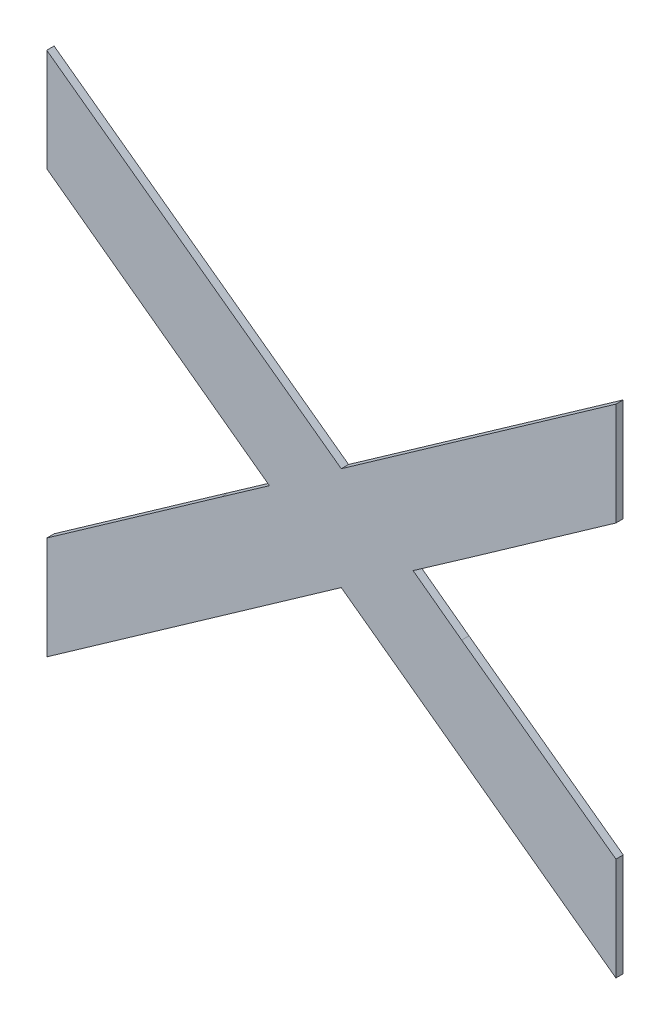
ISO-10303-21;
HEADER;
FILE_DESCRIPTION(('STEP AP214'),'2;1');
FILE_NAME('part.step','',(''),(''),'','','');
FILE_SCHEMA(('AUTOMOTIVE_DESIGN { 1 0 10303 214 1 1 1 1 }'));
ENDSEC;
DATA;
#1=APPLICATION_CONTEXT('core data for automotive mechanical design processes');
#2=APPLICATION_PROTOCOL_DEFINITION('international standard','automotive_design',2000,#1);
#3=PRODUCT_CONTEXT('',#1,'mechanical');
#4=PRODUCT('Part','Part','',(#3));
#5=PRODUCT_RELATED_PRODUCT_CATEGORY('part','',(#4));
#6=PRODUCT_DEFINITION_FORMATION('','',#4);
#7=PRODUCT_DEFINITION_CONTEXT('part definition',#1,'design');
#8=PRODUCT_DEFINITION('design','',#6,#7);
#9=PRODUCT_DEFINITION_SHAPE('','',#8);
#10=(LENGTH_UNIT() NAMED_UNIT(*) SI_UNIT(.MILLI.,.METRE.));
#11=(NAMED_UNIT(*) PLANE_ANGLE_UNIT() SI_UNIT($,.RADIAN.));
#12=(NAMED_UNIT(*) SI_UNIT($,.STERADIAN.) SOLID_ANGLE_UNIT());
#13=UNCERTAINTY_MEASURE_WITH_UNIT(LENGTH_MEASURE(1.E-05),#10,'distance_accuracy_value','');
#14=(GEOMETRIC_REPRESENTATION_CONTEXT(3) GLOBAL_UNCERTAINTY_ASSIGNED_CONTEXT((#13)) GLOBAL_UNIT_ASSIGNED_CONTEXT((#10,
#11,#12)) REPRESENTATION_CONTEXT('',''));
#15=CARTESIAN_POINT('',(0.,0.,0.));
#16=DIRECTION('',(0.,0.,1.));
#17=DIRECTION('',(1.,0.,0.));
#18=AXIS2_PLACEMENT_3D('',#15,#16,#17);
#19=CARTESIAN_POINT('',(1.151957455164,1.4491077046924,1.7496000059366));
#20=DIRECTION('',(0.589899014408719,0.807477029270568,0.));
#21=DIRECTION('',(0.,0.,-1.));
#22=AXIS2_PLACEMENT_3D('',#19,#20,#21);
#23=PLANE('',#22);
#24=DIRECTION('',(0.,0.,1.));
#25=VECTOR('',#24,1.);
#26=CARTESIAN_POINT('',(1.1439141430621,1.4549837131849,1.7492000059366));
#27=LINE('',#26,#25);
#28=CARTESIAN_POINT('',(1.1439141430621,1.4549837131849,1.7492000059366));
#29=VERTEX_POINT('',#28);
#30=CARTESIAN_POINT('',(1.1439141430621,1.4549837131849,1.7496000059366));
#31=VERTEX_POINT('',#30);
#32=EDGE_CURVE('E11',#29,#31,#27,.T.);
#33=ORIENTED_EDGE('',*,*,#32,.T.);
#34=DIRECTION('',(0.807477029270569,-0.589899014408719,0.));
#35=VECTOR('',#34,1.);
#36=CARTESIAN_POINT('',(1.1439141430621,1.4549837131849,1.7496000059366));
#37=LINE('',#36,#35);
#38=CARTESIAN_POINT('',(1.1600007672659,1.4432316961999,1.7496000059366));
#39=VERTEX_POINT('',#38);
#40=EDGE_CURVE('E24',#31,#39,#37,.T.);
#41=ORIENTED_EDGE('',*,*,#40,.T.);
#42=DIRECTION('',(0.,0.,1.));
#43=VECTOR('',#42,1.);
#44=CARTESIAN_POINT('',(1.1600007672659,1.4432316961999,1.7492000059366));
#45=LINE('',#44,#43);
#46=CARTESIAN_POINT('',(1.1600007672659,1.4432316961999,1.7492000059366));
#47=VERTEX_POINT('',#46);
#48=EDGE_CURVE('E249',#47,#39,#45,.T.);
#49=ORIENTED_EDGE('',*,*,#48,.F.);
#50=DIRECTION('',(0.807477029270569,-0.589899014408719,0.));
#51=VECTOR('',#50,1.);
#52=CARTESIAN_POINT('',(1.1439141430621,1.4549837131849,1.7492000059366));
#53=LINE('',#52,#51);
#54=EDGE_CURVE('E247',#29,#47,#53,.T.);
#55=ORIENTED_EDGE('',*,*,#54,.F.);
#56=EDGE_LOOP('',(#33,#41,#49,#55));
#57=FACE_BOUND('',#56,.T.);
#58=ADVANCED_FACE('F17',(#57),#23,.T.);
#59=CARTESIAN_POINT('',(1.1675022534654,1.4485098278347,1.7496000059366));
#60=DIRECTION('',(-0.575442948121089,0.81784192449257,0.));
#61=DIRECTION('',(0.,0.,1.));
#62=AXIS2_PLACEMENT_3D('',#59,#60,#61);
#63=PLANE('',#62);
#64=ORIENTED_EDGE('',*,*,#48,.T.);
#65=DIRECTION('',(0.81784192449257,0.575442948121089,0.));
#66=VECTOR('',#65,1.);
#67=CARTESIAN_POINT('',(1.1600007672659,1.4432316961999,1.7496000059366));
#68=LINE('',#67,#66);
#69=CARTESIAN_POINT('',(1.1750037396649,1.4537879594695,1.7496000059366));
#70=VERTEX_POINT('',#69);
#71=EDGE_CURVE('E245',#39,#70,#68,.T.);
#72=ORIENTED_EDGE('',*,*,#71,.T.);
#73=DIRECTION('',(0.,0.,1.));
#74=VECTOR('',#73,1.);
#75=CARTESIAN_POINT('',(1.1750037396649,1.4537879594695,1.7492000059366));
#76=LINE('',#75,#74);
#77=CARTESIAN_POINT('',(1.1750037396649,1.4537879594695,1.7492000059366));
#78=VERTEX_POINT('',#77);
#79=EDGE_CURVE('E242',#78,#70,#76,.T.);
#80=ORIENTED_EDGE('',*,*,#79,.F.);
#81=DIRECTION('',(0.81784192449257,0.575442948121089,0.));
#82=VECTOR('',#81,1.);
#83=CARTESIAN_POINT('',(1.1600007672659,1.4432316961999,1.7492000059366));
#84=LINE('',#83,#82);
#85=EDGE_CURVE('E239',#47,#78,#84,.T.);
#86=ORIENTED_EDGE('',*,*,#85,.F.);
#87=EDGE_LOOP('',(#64,#72,#80,#86));
#88=FACE_BOUND('',#87,.T.);
#89=ADVANCED_FACE('F255',(#88),#63,.T.);
#90=CARTESIAN_POINT('',(1.1750037396649,1.4509760698729,1.7496000059366));
#91=DIRECTION('',(1.,0.,0.));
#92=DIRECTION('',(0.,0.,-1.));
#93=AXIS2_PLACEMENT_3D('',#90,#91,#92);
#94=PLANE('',#93);
#95=ORIENTED_EDGE('',*,*,#79,.T.);
#96=DIRECTION('',(0.,-1.,0.));
#97=VECTOR('',#96,1.);
#98=CARTESIAN_POINT('',(1.1750037396649,1.4537879594695,1.7496000059366));
#99=LINE('',#98,#97);
#100=CARTESIAN_POINT('',(1.1750037396649,1.4481641802763,1.7496000059366));
#101=VERTEX_POINT('',#100);
#102=EDGE_CURVE('E237',#70,#101,#99,.T.);
#103=ORIENTED_EDGE('',*,*,#102,.T.);
#104=DIRECTION('',(0.,0.,1.));
#105=VECTOR('',#104,1.);
#106=CARTESIAN_POINT('',(1.1750037396649,1.4481641802763,1.7492000059366));
#107=LINE('',#106,#105);
#108=CARTESIAN_POINT('',(1.1750037396649,1.4481641802763,1.7492000059366));
#109=VERTEX_POINT('',#108);
#110=EDGE_CURVE('E234',#109,#101,#107,.T.);
#111=ORIENTED_EDGE('',*,*,#110,.F.);
#112=DIRECTION('',(0.,-1.,0.));
#113=VECTOR('',#112,1.);
#114=CARTESIAN_POINT('',(1.1750037396649,1.4537879594695,1.7492000059366));
#115=LINE('',#114,#113);
#116=EDGE_CURVE('E231',#78,#109,#115,.T.);
#117=ORIENTED_EDGE('',*,*,#116,.F.);
#118=EDGE_LOOP('',(#95,#103,#111,#117));
#119=FACE_BOUND('',#118,.T.);
#120=ADVANCED_FACE('F261',(#119),#94,.T.);
#121=CARTESIAN_POINT('',(1.1709867545269,1.4453336070279,1.7496000059366));
#122=DIRECTION('',(0.576011277079091,-0.817441746351209,0.));
#123=DIRECTION('',(0.,0.,-1.));
#124=AXIS2_PLACEMENT_3D('',#121,#122,#123);
#125=PLANE('',#124);
#126=ORIENTED_EDGE('',*,*,#110,.T.);
#127=DIRECTION('',(-0.817441746351209,-0.576011277079091,0.));
#128=VECTOR('',#127,1.);
#129=CARTESIAN_POINT('',(1.1750037396649,1.4481641802763,1.7496000059366));
#130=LINE('',#129,#128);
#131=CARTESIAN_POINT('',(1.1669697693889,1.4425030337795,1.7496000059366));
#132=VERTEX_POINT('',#131);
#133=EDGE_CURVE('E229',#101,#132,#130,.T.);
#134=ORIENTED_EDGE('',*,*,#133,.T.);
#135=DIRECTION('',(0.,0.,1.));
#136=VECTOR('',#135,1.);
#137=CARTESIAN_POINT('',(1.1669697693889,1.4425030337795,1.7492000059366));
#138=LINE('',#137,#136);
#139=CARTESIAN_POINT('',(1.1669697693889,1.4425030337795,1.7492000059366));
#140=VERTEX_POINT('',#139);
#141=EDGE_CURVE('E226',#140,#132,#138,.T.);
#142=ORIENTED_EDGE('',*,*,#141,.F.);
#143=DIRECTION('',(-0.817441746351209,-0.576011277079091,0.));
#144=VECTOR('',#143,1.);
#145=CARTESIAN_POINT('',(1.1750037396649,1.4481641802763,1.7492000059366));
#146=LINE('',#145,#144);
#147=EDGE_CURVE('E220',#109,#140,#146,.T.);
#148=ORIENTED_EDGE('',*,*,#147,.F.);
#149=EDGE_LOOP('',(#126,#134,#142,#148));
#150=FACE_BOUND('',#149,.T.);
#151=ADVANCED_FACE('F265',(#150),#125,.T.);
#152=CARTESIAN_POINT('',(1.1669697693889,1.4425030337795,1.7496000059366));
#153=CARTESIAN_POINT('',(1.1669697693889,1.4425030337795,1.7491200059366));
#154=CARTESIAN_POINT('',(1.1650266696013,1.4411391271977,1.7496000059366));
#155=CARTESIAN_POINT('',(1.1650266696013,1.4411391271977,1.7491200059366));
#156=CARTESIAN_POINT('',(1.1639243341449,1.4403730974737,1.7496000059366));
#157=CARTESIAN_POINT('',(1.1639243341449,1.4403730974737,1.7491200059366));
#158=B_SPLINE_SURFACE_WITH_KNOTS('',2,1,((#152,#153),(#154,#155),(#156,#157)),.UNSPECIFIED.,.F.,
.F.,.F.,(3,3),(2,2),(0.,1.),(0.,0.000239999999999974),.UNSPECIFIED.);
#159=CARTESIAN_POINT('',(1.1669697693889,1.4425030337795,1.7496000059366));
#160=CARTESIAN_POINT('',(1.1650266696013,1.4411391271977,1.7496000059366));
#161=CARTESIAN_POINT('',(1.1639243341449,1.4403730974737,1.7496000059366));
#162=B_SPLINE_CURVE_WITH_KNOTS('',2,(#159,#160,#161),.UNSPECIFIED.,.F.,.F.,(3,3),(0.,1.),.UNSPECIFIED.);
#163=CARTESIAN_POINT('',(1.1639243342389,1.4403730974042,1.7496000059366));
#164=VERTEX_POINT('',#163);
#165=EDGE_CURVE('E216',#132,#164,#162,.T.);
#166=DIRECTION('',(0.,0.,1.));
#167=VECTOR('',#166,1.);
#168=CARTESIAN_POINT('',(1.1639243341449,1.4403730974737,1.7492000059366));
#169=LINE('',#168,#167);
#170=CARTESIAN_POINT('',(1.1639243342389,1.4403730974042,1.7492000059366));
#171=VERTEX_POINT('',#170);
#172=EDGE_CURVE('E210',#171,#164,#169,.T.);
#173=CARTESIAN_POINT('',(1.1669697693889,1.4425030337795,1.7492000059366));
#174=CARTESIAN_POINT('',(1.1650266696013,1.4411391271977,1.7492000059366));
#175=CARTESIAN_POINT('',(1.1639243341449,1.4403730974737,1.7492000059366));
#176=B_SPLINE_CURVE_WITH_KNOTS('',2,(#173,#174,#175),.UNSPECIFIED.,.F.,.F.,(3,3),(0.,1.),.UNSPECIFIED.);
#177=EDGE_CURVE('E205',#140,#171,#176,.T.);
#178=ORIENTED_EDGE('',*,*,#141,.T.);
#179=ORIENTED_EDGE('',*,*,#165,.T.);
#180=ORIENTED_EDGE('',*,*,#172,.F.);
#181=ORIENTED_EDGE('',*,*,#177,.F.);
#182=EDGE_LOOP('',(#178,#179,#180,#181));
#183=FACE_BOUND('',#182,.T.);
#184=ADVANCED_FACE('F269',(#183),#158,.T.);
#185=CARTESIAN_POINT('',(1.1651948224676,1.4394342439705,1.7496000059366));
#186=DIRECTION('',(0.594550260696468,0.804058447816925,0.));
#187=DIRECTION('',(0.,0.,-1.));
#188=AXIS2_PLACEMENT_3D('',#185,#186,#187);
#189=PLANE('',#188);
#190=ORIENTED_EDGE('',*,*,#172,.T.);
#191=DIRECTION('',(0.804058447816925,-0.594550260696468,0.));
#192=VECTOR('',#191,1.);
#193=CARTESIAN_POINT('',(1.1639243341449,1.4403730974737,1.7496000059366));
#194=LINE('',#193,#192);
#195=CARTESIAN_POINT('',(1.1665774128468,1.438411313928,1.7496000059366));
#196=VERTEX_POINT('',#195);
#197=EDGE_CURVE('E203',#164,#196,#194,.T.);
#198=ORIENTED_EDGE('',*,*,#197,.T.);
#199=DIRECTION('',(0.,0.,1.));
#200=VECTOR('',#199,1.);
#201=CARTESIAN_POINT('',(1.1665774127011,1.4384113140343,1.7492000059366));
#202=LINE('',#201,#200);
#203=CARTESIAN_POINT('',(1.1665774128468,1.438411313928,1.7492000059366));
#204=VERTEX_POINT('',#203);
#205=EDGE_CURVE('E200',#204,#196,#202,.T.);
#206=ORIENTED_EDGE('',*,*,#205,.F.);
#207=DIRECTION('',(0.804058447816925,-0.594550260696468,0.));
#208=VECTOR('',#207,1.);
#209=CARTESIAN_POINT('',(1.1639243341449,1.4403730974737,1.7492000059366));
#210=LINE('',#209,#208);
#211=EDGE_CURVE('E197',#171,#204,#210,.T.);
#212=ORIENTED_EDGE('',*,*,#211,.F.);
#213=EDGE_LOOP('',(#190,#198,#206,#212));
#214=FACE_BOUND('',#213,.T.);
#215=ADVANCED_FACE('F272',(#214),#189,.T.);
#216=CARTESIAN_POINT('',(1.170790576183,1.4353378533124,1.7496000059366));
#217=DIRECTION('',(0.589342697437153,0.807883150571604,0.));
#218=DIRECTION('',(0.,0.,-1.));
#219=AXIS2_PLACEMENT_3D('',#216,#217,#218);
#220=PLANE('',#219);
#221=ORIENTED_EDGE('',*,*,#205,.T.);
#222=DIRECTION('',(0.807883150571604,-0.589342697437153,0.));
#223=VECTOR('',#222,1.);
#224=CARTESIAN_POINT('',(1.1665774127011,1.4384113140343,1.7496000059366));
#225=LINE('',#224,#223);
#226=CARTESIAN_POINT('',(1.1750037396649,1.4322643925905,1.7496000059366));
#227=VERTEX_POINT('',#226);
#228=EDGE_CURVE('E195',#196,#227,#225,.T.);
#229=ORIENTED_EDGE('',*,*,#228,.T.);
#230=DIRECTION('',(0.,0.,1.));
#231=VECTOR('',#230,1.);
#232=CARTESIAN_POINT('',(1.1750037396649,1.4322643925905,1.7492000059366));
#233=LINE('',#232,#231);
#234=CARTESIAN_POINT('',(1.1750037396649,1.4322643925905,1.7492000059366));
#235=VERTEX_POINT('',#234);
#236=EDGE_CURVE('E192',#235,#227,#233,.T.);
#237=ORIENTED_EDGE('',*,*,#236,.F.);
#238=DIRECTION('',(0.807883150571604,-0.589342697437153,0.));
#239=VECTOR('',#238,1.);
#240=CARTESIAN_POINT('',(1.1665774127011,1.4384113140343,1.7492000059366));
#241=LINE('',#240,#239);
#242=EDGE_CURVE('E189',#204,#235,#241,.T.);
#243=ORIENTED_EDGE('',*,*,#242,.F.);
#244=EDGE_LOOP('',(#221,#229,#237,#243));
#245=FACE_BOUND('',#244,.T.);
#246=ADVANCED_FACE('F277',(#245),#220,.T.);
#247=CARTESIAN_POINT('',(1.1750037396649,1.4294525029939,1.7496000059366));
#248=DIRECTION('',(1.,0.,0.));
#249=DIRECTION('',(0.,0.,-1.));
#250=AXIS2_PLACEMENT_3D('',#247,#248,#249);
#251=PLANE('',#250);
#252=ORIENTED_EDGE('',*,*,#236,.T.);
#253=DIRECTION('',(0.,-1.,0.));
#254=VECTOR('',#253,1.);
#255=CARTESIAN_POINT('',(1.1750037396649,1.4322643925905,1.7496000059366));
#256=LINE('',#255,#254);
#257=CARTESIAN_POINT('',(1.1750037396649,1.4266406133973,1.7496000059366));
#258=VERTEX_POINT('',#257);
#259=EDGE_CURVE('E187',#227,#258,#256,.T.);
#260=ORIENTED_EDGE('',*,*,#259,.T.);
#261=DIRECTION('',(0.,0.,1.));
#262=VECTOR('',#261,1.);
#263=CARTESIAN_POINT('',(1.1750037396649,1.4266406133973,1.7492000059366));
#264=LINE('',#263,#262);
#265=CARTESIAN_POINT('',(1.1750037396649,1.4266406133973,1.7492000059366));
#266=VERTEX_POINT('',#265);
#267=EDGE_CURVE('E184',#266,#258,#264,.T.);
#268=ORIENTED_EDGE('',*,*,#267,.F.);
#269=DIRECTION('',(0.,-1.,0.));
#270=VECTOR('',#269,1.);
#271=CARTESIAN_POINT('',(1.1750037396649,1.4322643925905,1.7492000059366));
#272=LINE('',#271,#270);
#273=EDGE_CURVE('E181',#235,#266,#272,.T.);
#274=ORIENTED_EDGE('',*,*,#273,.F.);
#275=EDGE_LOOP('',(#252,#260,#268,#274));
#276=FACE_BOUND('',#275,.T.);
#277=ADVANCED_FACE('F281',(#276),#251,.T.);
#278=CARTESIAN_POINT('',(1.1675022534654,1.432124265202,1.7496000059366));
#279=DIRECTION('',(-0.590142614926871,-0.807299011548556,0.));
#280=DIRECTION('',(0.,0.,1.));
#281=AXIS2_PLACEMENT_3D('',#278,#279,#280);
#282=PLANE('',#281);
#283=ORIENTED_EDGE('',*,*,#267,.T.);
#284=DIRECTION('',(-0.807299011548556,0.590142614926871,0.));
#285=VECTOR('',#284,1.);
#286=CARTESIAN_POINT('',(1.1750037396649,1.4266406133973,1.7496000059366));
#287=LINE('',#286,#285);
#288=CARTESIAN_POINT('',(1.1600007672659,1.4376079170067,1.7496000059366));
#289=VERTEX_POINT('',#288);
#290=EDGE_CURVE('E179',#258,#289,#287,.T.);
#291=ORIENTED_EDGE('',*,*,#290,.T.);
#292=DIRECTION('',(0.,0.,1.));
#293=VECTOR('',#292,1.);
#294=CARTESIAN_POINT('',(1.1600007672659,1.4376079170067,1.7492000059366));
#295=LINE('',#294,#293);
#296=CARTESIAN_POINT('',(1.1600007672659,1.4376079170067,1.7492000059366));
#297=VERTEX_POINT('',#296);
#298=EDGE_CURVE('E176',#297,#289,#295,.T.);
#299=ORIENTED_EDGE('',*,*,#298,.F.);
#300=DIRECTION('',(-0.807299011548556,0.590142614926871,0.));
#301=VECTOR('',#300,1.);
#302=CARTESIAN_POINT('',(1.1750037396649,1.4266406133973,1.7492000059366));
#303=LINE('',#302,#301);
#304=EDGE_CURVE('E173',#266,#297,#303,.T.);
#305=ORIENTED_EDGE('',*,*,#304,.F.);
#306=EDGE_LOOP('',(#283,#291,#299,#305));
#307=FACE_BOUND('',#306,.T.);
#308=ADVANCED_FACE('F285',(#307),#282,.T.);
#309=CARTESIAN_POINT('',(1.151957455164,1.4319467705098,1.7496000059366));
#310=DIRECTION('',(0.575563983688675,-0.817756749088886,0.));
#311=DIRECTION('',(0.,0.,-1.));
#312=AXIS2_PLACEMENT_3D('',#309,#310,#311);
#313=PLANE('',#312);
#314=ORIENTED_EDGE('',*,*,#298,.T.);
#315=DIRECTION('',(-0.817756749088886,-0.575563983688675,0.));
#316=VECTOR('',#315,1.);
#317=CARTESIAN_POINT('',(1.1600007672659,1.4376079170067,1.7496000059366));
#318=LINE('',#317,#316);
#319=CARTESIAN_POINT('',(1.1439141430621,1.4262856240129,1.7496000059366));
#320=VERTEX_POINT('',#319);
#321=EDGE_CURVE('E171',#289,#320,#318,.T.);
#322=ORIENTED_EDGE('',*,*,#321,.T.);
#323=DIRECTION('',(0.,0.,1.));
#324=VECTOR('',#323,1.);
#325=CARTESIAN_POINT('',(1.1439141430621,1.4262856240129,1.7492000059366));
#326=LINE('',#325,#324);
#327=CARTESIAN_POINT('',(1.1439141430621,1.4262856240129,1.7492000059366));
#328=VERTEX_POINT('',#327);
#329=EDGE_CURVE('E168',#328,#320,#326,.T.);
#330=ORIENTED_EDGE('',*,*,#329,.F.);
#331=DIRECTION('',(-0.817756749088886,-0.575563983688675,0.));
#332=VECTOR('',#331,1.);
#333=CARTESIAN_POINT('',(1.1600007672659,1.4376079170067,1.7492000059366));
#334=LINE('',#333,#332);
#335=EDGE_CURVE('E165',#297,#328,#334,.T.);
#336=ORIENTED_EDGE('',*,*,#335,.F.);
#337=EDGE_LOOP('',(#314,#322,#330,#336));
#338=FACE_BOUND('',#337,.T.);
#339=ADVANCED_FACE('F288',(#338),#313,.T.);
#340=CARTESIAN_POINT('',(1.1439141430621,1.4290975136096,1.7496000059366));
#341=DIRECTION('',(-1.,0.,0.));
#342=DIRECTION('',(0.,0.,1.));
#343=AXIS2_PLACEMENT_3D('',#340,#341,#342);
#344=PLANE('',#343);
#345=ORIENTED_EDGE('',*,*,#329,.T.);
#346=DIRECTION('',(0.,1.,0.));
#347=VECTOR('',#346,1.);
#348=CARTESIAN_POINT('',(1.1439141430621,1.4262856240129,1.7496000059366));
#349=LINE('',#348,#347);
#350=CARTESIAN_POINT('',(1.1439141430621,1.4319094032063,1.7496000059366));
#351=VERTEX_POINT('',#350);
#352=EDGE_CURVE('E163',#320,#351,#349,.T.);
#353=ORIENTED_EDGE('',*,*,#352,.T.);
#354=DIRECTION('',(0.,0.,1.));
#355=VECTOR('',#354,1.);
#356=CARTESIAN_POINT('',(1.1439141430621,1.4319094032063,1.7492000059366));
#357=LINE('',#356,#355);
#358=CARTESIAN_POINT('',(1.1439141430621,1.4319094032063,1.7492000059366));
#359=VERTEX_POINT('',#358);
#360=EDGE_CURVE('E160',#359,#351,#357,.T.);
#361=ORIENTED_EDGE('',*,*,#360,.F.);
#362=DIRECTION('',(0.,1.,0.));
#363=VECTOR('',#362,1.);
#364=CARTESIAN_POINT('',(1.1439141430621,1.4262856240129,1.7492000059366));
#365=LINE('',#364,#363);
#366=EDGE_CURVE('E157',#328,#359,#365,.T.);
#367=ORIENTED_EDGE('',*,*,#366,.F.);
#368=EDGE_LOOP('',(#345,#353,#361,#367));
#369=FACE_BOUND('',#368,.T.);
#370=ADVANCED_FACE('F293',(#369),#344,.T.);
#371=CARTESIAN_POINT('',(1.1486784742722,1.4352631187052,1.7496000059366));
#372=DIRECTION('',(-0.575612550146399,0.817722564268566,0.));
#373=DIRECTION('',(0.,0.,1.));
#374=AXIS2_PLACEMENT_3D('',#371,#372,#373);
#375=PLANE('',#374);
#376=ORIENTED_EDGE('',*,*,#360,.T.);
#377=DIRECTION('',(0.817722564268566,0.575612550146399,0.));
#378=VECTOR('',#377,1.);
#379=CARTESIAN_POINT('',(1.1439141430621,1.4319094032063,1.7496000059366));
#380=LINE('',#379,#378);
#381=CARTESIAN_POINT('',(1.1534428054823,1.4386168342041,1.7496000059366));
#382=VERTEX_POINT('',#381);
#383=EDGE_CURVE('E155',#351,#382,#380,.T.);
#384=ORIENTED_EDGE('',*,*,#383,.T.);
#385=DIRECTION('',(0.,0.,1.));
#386=VECTOR('',#385,1.);
#387=CARTESIAN_POINT('',(1.1534428054823,1.4386168342041,1.7492000059366));
#388=LINE('',#387,#386);
#389=CARTESIAN_POINT('',(1.1534428054823,1.4386168342041,1.7492000059366));
#390=VERTEX_POINT('',#389);
#391=EDGE_CURVE('E152',#390,#382,#388,.T.);
#392=ORIENTED_EDGE('',*,*,#391,.F.);
#393=DIRECTION('',(0.817722564268566,0.575612550146399,0.));
#394=VECTOR('',#393,1.);
#395=CARTESIAN_POINT('',(1.1439141430621,1.4319094032063,1.7492000059366));
#396=LINE('',#395,#394);
#397=EDGE_CURVE('E150',#359,#390,#396,.T.);
#398=ORIENTED_EDGE('',*,*,#397,.F.);
#399=EDGE_LOOP('',(#376,#384,#392,#398));
#400=FACE_BOUND('',#399,.T.);
#401=ADVANCED_FACE('F297',(#400),#375,.T.);
#402=CARTESIAN_POINT('',(1.1547600029346,1.4395416749684,1.7496000059366));
#403=DIRECTION('',(-0.574630421442307,0.818413024549974,0.));
#404=DIRECTION('',(0.,0.,1.));
#405=AXIS2_PLACEMENT_3D('',#402,#403,#404);
#406=PLANE('',#405);
#407=ORIENTED_EDGE('',*,*,#391,.T.);
#408=DIRECTION('',(0.818413024549974,0.574630421442307,0.));
#409=VECTOR('',#408,1.);
#410=CARTESIAN_POINT('',(1.1534428054823,1.4386168342041,1.7496000059366));
#411=LINE('',#410,#409);
#412=CARTESIAN_POINT('',(1.1560772003869,1.4404665157327,1.7496000059366));
#413=VERTEX_POINT('',#412);
#414=EDGE_CURVE('E148',#382,#413,#411,.T.);
#415=ORIENTED_EDGE('',*,*,#414,.T.);
#416=DIRECTION('',(0.,0.,1.));
#417=VECTOR('',#416,1.);
#418=CARTESIAN_POINT('',(1.1560772003869,1.4404665157327,1.7492000059366));
#419=LINE('',#418,#417);
#420=CARTESIAN_POINT('',(1.1560772003869,1.4404665157327,1.7492000059366));
#421=VERTEX_POINT('',#420);
#422=EDGE_CURVE('E146',#421,#413,#419,.T.);
#423=ORIENTED_EDGE('',*,*,#422,.F.);
#424=DIRECTION('',(0.818413024549974,0.574630421442307,0.));
#425=VECTOR('',#424,1.);
#426=CARTESIAN_POINT('',(1.1534428054823,1.4386168342041,1.7492000059366));
#427=LINE('',#426,#425);
#428=EDGE_CURVE('E137',#390,#421,#427,.T.);
#429=ORIENTED_EDGE('',*,*,#428,.F.);
#430=EDGE_LOOP('',(#407,#415,#423,#429));
#431=FACE_BOUND('',#430,.T.);
#432=ADVANCED_FACE('F299',(#431),#406,.T.);
#433=CARTESIAN_POINT('',(1.1499956717245,1.4449225666881,1.7496000059366));
#434=DIRECTION('',(-0.591041312264838,-0.80664128780782,0.));
#435=DIRECTION('',(0.,0.,1.));
#436=AXIS2_PLACEMENT_3D('',#433,#434,#435);
#437=PLANE('',#436);
#438=ORIENTED_EDGE('',*,*,#422,.T.);
#439=DIRECTION('',(-0.80664128780782,0.591041312264838,0.));
#440=VECTOR('',#439,1.);
#441=CARTESIAN_POINT('',(1.1560772003869,1.4404665157327,1.7496000059366));
#442=LINE('',#441,#440);
#443=CARTESIAN_POINT('',(1.1439141430621,1.4493786176435,1.7496000059366));
#444=VERTEX_POINT('',#443);
#445=EDGE_CURVE('E126',#413,#444,#442,.T.);
#446=ORIENTED_EDGE('',*,*,#445,.T.);
#447=DIRECTION('',(0.,0.,1.));
#448=VECTOR('',#447,1.);
#449=CARTESIAN_POINT('',(1.1439141430621,1.4493786176435,1.7492000059366));
#450=LINE('',#449,#448);
#451=CARTESIAN_POINT('',(1.1439141430621,1.4493786176435,1.7492000059366));
#452=VERTEX_POINT('',#451);
#453=EDGE_CURVE('E120',#452,#444,#450,.T.);
#454=ORIENTED_EDGE('',*,*,#453,.F.);
#455=DIRECTION('',(-0.80664128780782,0.591041312264838,0.));
#456=VECTOR('',#455,1.);
#457=CARTESIAN_POINT('',(1.1560772003869,1.4404665157327,1.7492000059366));
#458=LINE('',#457,#456);
#459=EDGE_CURVE('E124',#421,#452,#458,.T.);
#460=ORIENTED_EDGE('',*,*,#459,.F.);
#461=EDGE_LOOP('',(#438,#446,#454,#460));
#462=FACE_BOUND('',#461,.T.);
#463=ADVANCED_FACE('F123',(#462),#437,.T.);
#464=CARTESIAN_POINT('',(1.1439141430621,1.4521811654142,1.7496000059366));
#465=DIRECTION('',(-1.,0.,0.));
#466=DIRECTION('',(0.,0.,1.));
#467=AXIS2_PLACEMENT_3D('',#464,#465,#466);
#468=PLANE('',#467);
#469=ORIENTED_EDGE('',*,*,#453,.T.);
#470=DIRECTION('',(0.,1.,0.));
#471=VECTOR('',#470,1.);
#472=CARTESIAN_POINT('',(1.1439141430621,1.4493786176435,1.7496000059366));
#473=LINE('',#472,#471);
#474=EDGE_CURVE('E138',#444,#31,#473,.T.);
#475=ORIENTED_EDGE('',*,*,#474,.T.);
#476=ORIENTED_EDGE('',*,*,#32,.F.);
#477=DIRECTION('',(0.,1.,0.));
#478=VECTOR('',#477,1.);
#479=CARTESIAN_POINT('',(1.1439141430621,1.4493786176435,1.7492000059366));
#480=LINE('',#479,#478);
#481=EDGE_CURVE('E134',#452,#29,#480,.T.);
#482=ORIENTED_EDGE('',*,*,#481,.F.);
#483=EDGE_LOOP('',(#469,#475,#476,#482));
#484=FACE_BOUND('',#483,.T.);
#485=ADVANCED_FACE('F140',(#484),#468,.T.);
#486=CARTESIAN_POINT('',(1.1439141430621,1.4406346685989,1.7492000059366));
#487=DIRECTION('',(0.,0.,-1.));
#488=DIRECTION('',(-1.,0.,0.));
#489=AXIS2_PLACEMENT_3D('',#486,#487,#488);
#490=PLANE('',#489);
#491=ORIENTED_EDGE('',*,*,#54,.T.);
#492=ORIENTED_EDGE('',*,*,#85,.T.);
#493=ORIENTED_EDGE('',*,*,#116,.T.);
#494=ORIENTED_EDGE('',*,*,#147,.T.);
#495=ORIENTED_EDGE('',*,*,#177,.T.);
#496=ORIENTED_EDGE('',*,*,#211,.T.);
#497=ORIENTED_EDGE('',*,*,#242,.T.);
#498=ORIENTED_EDGE('',*,*,#273,.T.);
#499=ORIENTED_EDGE('',*,*,#304,.T.);
#500=ORIENTED_EDGE('',*,*,#335,.T.);
#501=ORIENTED_EDGE('',*,*,#366,.T.);
#502=ORIENTED_EDGE('',*,*,#397,.T.);
#503=ORIENTED_EDGE('',*,*,#428,.T.);
#504=ORIENTED_EDGE('',*,*,#459,.T.);
#505=ORIENTED_EDGE('',*,*,#481,.T.);
#506=EDGE_LOOP('',(#491,#492,#493,#494,#495,#496,#497,#498,#499,#500,#501,#502,#503,#504,#505));
#507=FACE_BOUND('',#506,.T.);
#508=ADVANCED_FACE('F133',(#507),#490,.T.);
#509=CARTESIAN_POINT('',(1.1439141430621,1.4406346685989,1.7496000059366));
#510=DIRECTION('',(0.,0.,-1.));
#511=DIRECTION('',(-1.,0.,0.));
#512=AXIS2_PLACEMENT_3D('',#509,#510,#511);
#513=PLANE('',#512);
#514=ORIENTED_EDGE('',*,*,#40,.F.);
#515=ORIENTED_EDGE('',*,*,#474,.F.);
#516=ORIENTED_EDGE('',*,*,#445,.F.);
#517=ORIENTED_EDGE('',*,*,#414,.F.);
#518=ORIENTED_EDGE('',*,*,#383,.F.);
#519=ORIENTED_EDGE('',*,*,#352,.F.);
#520=ORIENTED_EDGE('',*,*,#321,.F.);
#521=ORIENTED_EDGE('',*,*,#290,.F.);
#522=ORIENTED_EDGE('',*,*,#259,.F.);
#523=ORIENTED_EDGE('',*,*,#228,.F.);
#524=ORIENTED_EDGE('',*,*,#197,.F.);
#525=ORIENTED_EDGE('',*,*,#165,.F.);
#526=ORIENTED_EDGE('',*,*,#133,.F.);
#527=ORIENTED_EDGE('',*,*,#102,.F.);
#528=ORIENTED_EDGE('',*,*,#71,.F.);
#529=EDGE_LOOP('',(#514,#515,#516,#517,#518,#519,#520,#521,#522,#523,#524,#525,#526,#527,#528));
#530=FACE_BOUND('',#529,.T.);
#531=ADVANCED_FACE('F257',(#530),#513,.F.);
#532=CLOSED_SHELL('',(#58,#89,#120,#151,#184,#215,#246,#277,#308,#339,#370,#401,#432,#463,#485,
#508,#531));
#533=MANIFOLD_SOLID_BREP('B1',#532);
#534=ADVANCED_BREP_SHAPE_REPRESENTATION('',(#18,#533),#14);
#535=SHAPE_DEFINITION_REPRESENTATION(#9,#534);
ENDSEC;
END-ISO-10303-21;
